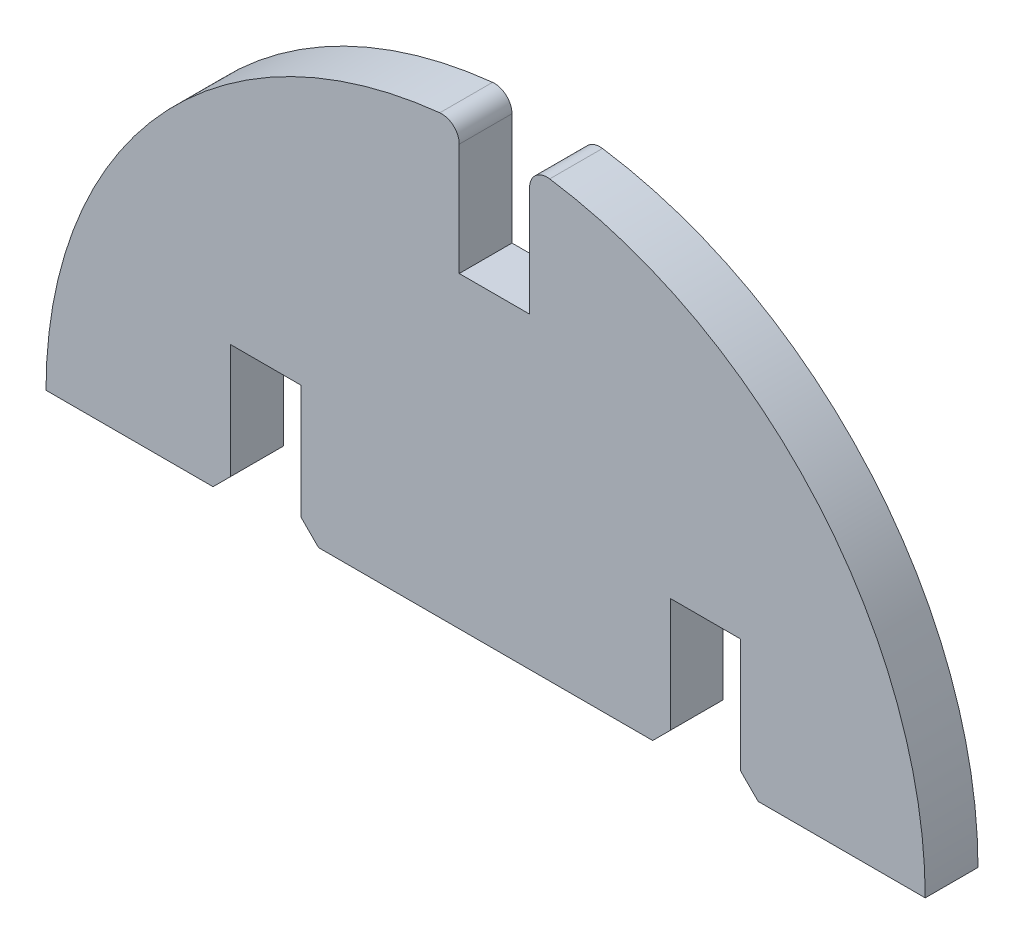
ISO-10303-21;
HEADER;
FILE_DESCRIPTION(('STEP AP214'),'2;1');
FILE_NAME('part.step','',(''),(''),'','','');
FILE_SCHEMA(('AUTOMOTIVE_DESIGN { 1 0 10303 214 1 1 1 1 }'));
ENDSEC;
DATA;
#1=APPLICATION_CONTEXT('core data for automotive mechanical design processes');
#2=APPLICATION_PROTOCOL_DEFINITION('international standard','automotive_design',2000,#1);
#3=PRODUCT_CONTEXT('',#1,'mechanical');
#4=PRODUCT('Part','Part','',(#3));
#5=PRODUCT_RELATED_PRODUCT_CATEGORY('part','',(#4));
#6=PRODUCT_DEFINITION_FORMATION('','',#4);
#7=PRODUCT_DEFINITION_CONTEXT('part definition',#1,'design');
#8=PRODUCT_DEFINITION('design','',#6,#7);
#9=PRODUCT_DEFINITION_SHAPE('','',#8);
#10=(LENGTH_UNIT() NAMED_UNIT(*) SI_UNIT(.MILLI.,.METRE.));
#11=(NAMED_UNIT(*) PLANE_ANGLE_UNIT() SI_UNIT($,.RADIAN.));
#12=(NAMED_UNIT(*) SI_UNIT($,.STERADIAN.) SOLID_ANGLE_UNIT());
#13=UNCERTAINTY_MEASURE_WITH_UNIT(LENGTH_MEASURE(1.E-05),#10,'distance_accuracy_value','');
#14=(GEOMETRIC_REPRESENTATION_CONTEXT(3) GLOBAL_UNCERTAINTY_ASSIGNED_CONTEXT((#13)) GLOBAL_UNIT_ASSIGNED_CONTEXT((#10,
#11,#12)) REPRESENTATION_CONTEXT('',''));
#15=CARTESIAN_POINT('',(0.,0.,0.));
#16=DIRECTION('',(0.,0.,1.));
#17=DIRECTION('',(1.,0.,0.));
#18=AXIS2_PLACEMENT_3D('',#15,#16,#17);
#19=CARTESIAN_POINT('',(-2.5,23.86943652456,3.));
#20=DIRECTION('',(0.,0.,-1.));
#21=DIRECTION('',(-1.,0.,0.));
#22=AXIS2_PLACEMENT_3D('',#19,#20,#21);
#23=CYLINDRICAL_SURFACE('',#22,0.999999999999998);
#24=CARTESIAN_POINT('',(-2.5,23.86943652456,0.));
#25=DIRECTION('',(0.,0.,1.));
#26=DIRECTION('',(1.,0.,0.));
#27=AXIS2_PLACEMENT_3D('',#24,#25,#26);
#28=CIRCLE('',#27,0.999999999999998);
#29=CARTESIAN_POINT('',(-1.5,23.86943652456,0.));
#30=VERTEX_POINT('',#29);
#31=CARTESIAN_POINT('',(-2.60416666666666,24.86399637975,0.));
#32=VERTEX_POINT('',#31);
#33=EDGE_CURVE('E201',#30,#32,#28,.T.);
#34=ORIENTED_EDGE('',*,*,#33,.T.);
#35=DIRECTION('',(0.,0.,-1.));
#36=VECTOR('',#35,1.);
#37=CARTESIAN_POINT('',(-2.60416666666666,24.86399637975,3.));
#38=LINE('',#37,#36);
#39=CARTESIAN_POINT('',(-2.60416666666666,24.86399637975,3.));
#40=VERTEX_POINT('',#39);
#41=EDGE_CURVE('E11',#40,#32,#38,.T.);
#42=ORIENTED_EDGE('',*,*,#41,.F.);
#43=CARTESIAN_POINT('',(-2.5,23.86943652456,3.));
#44=DIRECTION('',(0.,0.,1.));
#45=DIRECTION('',(1.,0.,0.));
#46=AXIS2_PLACEMENT_3D('',#43,#44,#45);
#47=CIRCLE('',#46,0.999999999999998);
#48=CARTESIAN_POINT('',(-1.5,23.86943652456,3.));
#49=VERTEX_POINT('',#48);
#50=EDGE_CURVE('E247',#49,#40,#47,.T.);
#51=ORIENTED_EDGE('',*,*,#50,.F.);
#52=DIRECTION('',(0.,0.,-1.));
#53=VECTOR('',#52,1.);
#54=CARTESIAN_POINT('',(-1.5,23.86943652456,3.));
#55=LINE('',#54,#53);
#56=EDGE_CURVE('E49',#49,#30,#55,.T.);
#57=ORIENTED_EDGE('',*,*,#56,.T.);
#58=EDGE_LOOP('',(#34,#42,#51,#57));
#59=FACE_BOUND('',#58,.T.);
#60=ADVANCED_FACE('F33',(#59),#23,.T.);
#61=CARTESIAN_POINT('',(0.,0.,3.));
#62=DIRECTION('',(0.,0.,-1.));
#63=DIRECTION('',(-1.,0.,0.));
#64=AXIS2_PLACEMENT_3D('',#61,#62,#63);
#65=CYLINDRICAL_SURFACE('',#64,25.);
#66=CARTESIAN_POINT('',(0.,0.,0.));
#67=DIRECTION('',(0.,0.,1.));
#68=DIRECTION('',(1.,0.,0.));
#69=AXIS2_PLACEMENT_3D('',#66,#67,#68);
#70=CIRCLE('',#69,25.);
#71=CARTESIAN_POINT('',(-25.,0.,0.));
#72=VERTEX_POINT('',#71);
#73=EDGE_CURVE('E203',#32,#72,#70,.T.);
#74=ORIENTED_EDGE('',*,*,#73,.T.);
#75=DIRECTION('',(0.,0.,-1.));
#76=VECTOR('',#75,1.);
#77=CARTESIAN_POINT('',(-25.,0.,3.));
#78=LINE('',#77,#76);
#79=CARTESIAN_POINT('',(-25.,0.,3.));
#80=VERTEX_POINT('',#79);
#81=EDGE_CURVE('E41',#80,#72,#78,.T.);
#82=ORIENTED_EDGE('',*,*,#81,.F.);
#83=CARTESIAN_POINT('',(0.,0.,3.));
#84=DIRECTION('',(0.,0.,1.));
#85=DIRECTION('',(1.,0.,0.));
#86=AXIS2_PLACEMENT_3D('',#83,#84,#85);
#87=CIRCLE('',#86,25.);
#88=EDGE_CURVE('E123',#40,#80,#87,.T.);
#89=ORIENTED_EDGE('',*,*,#88,.F.);
#90=ORIENTED_EDGE('',*,*,#41,.T.);
#91=EDGE_LOOP('',(#74,#82,#89,#90));
#92=FACE_BOUND('',#91,.T.);
#93=ADVANCED_FACE('F350',(#92),#65,.T.);
#94=CARTESIAN_POINT('',(-25.,0.,3.));
#95=DIRECTION('',(0.,1.,0.));
#96=DIRECTION('',(-1.,0.,0.));
#97=AXIS2_PLACEMENT_3D('',#94,#95,#96);
#98=PLANE('',#97);
#99=DIRECTION('',(1.,0.,0.));
#100=VECTOR('',#99,1.);
#101=CARTESIAN_POINT('',(-25.,0.,0.));
#102=LINE('',#101,#100);
#103=CARTESIAN_POINT('',(-15.5,0.,0.));
#104=VERTEX_POINT('',#103);
#105=EDGE_CURVE('E205',#72,#104,#102,.T.);
#106=ORIENTED_EDGE('',*,*,#105,.T.);
#107=DIRECTION('',(0.,0.,-1.));
#108=VECTOR('',#107,1.);
#109=CARTESIAN_POINT('',(-15.5,0.,3.));
#110=LINE('',#109,#108);
#111=CARTESIAN_POINT('',(-15.5,0.,3.));
#112=VERTEX_POINT('',#111);
#113=EDGE_CURVE('E285',#112,#104,#110,.T.);
#114=ORIENTED_EDGE('',*,*,#113,.F.);
#115=DIRECTION('',(1.,0.,0.));
#116=VECTOR('',#115,1.);
#117=CARTESIAN_POINT('',(-25.,0.,3.));
#118=LINE('',#117,#116);
#119=EDGE_CURVE('E293',#80,#112,#118,.T.);
#120=ORIENTED_EDGE('',*,*,#119,.F.);
#121=ORIENTED_EDGE('',*,*,#81,.T.);
#122=EDGE_LOOP('',(#106,#114,#120,#121));
#123=FACE_BOUND('',#122,.T.);
#124=ADVANCED_FACE('F291',(#123),#98,.F.);
#125=CARTESIAN_POINT('',(-15.5,0.,3.));
#126=DIRECTION('',(-0.707106781186547,0.707106781186548,0.));
#127=DIRECTION('',(-0.707106781186548,-0.707106781186547,0.));
#128=AXIS2_PLACEMENT_3D('',#125,#126,#127);
#129=PLANE('',#128);
#130=DIRECTION('',(0.707106781186548,0.707106781186547,0.));
#131=VECTOR('',#130,1.);
#132=CARTESIAN_POINT('',(-15.5,0.,0.));
#133=LINE('',#132,#131);
#134=CARTESIAN_POINT('',(-14.5,1.,0.));
#135=VERTEX_POINT('',#134);
#136=EDGE_CURVE('E207',#104,#135,#133,.T.);
#137=ORIENTED_EDGE('',*,*,#136,.T.);
#138=DIRECTION('',(0.,0.,-1.));
#139=VECTOR('',#138,1.);
#140=CARTESIAN_POINT('',(-14.5,1.,3.));
#141=LINE('',#140,#139);
#142=CARTESIAN_POINT('',(-14.5,1.,3.));
#143=VERTEX_POINT('',#142);
#144=EDGE_CURVE('E283',#143,#135,#141,.T.);
#145=ORIENTED_EDGE('',*,*,#144,.F.);
#146=DIRECTION('',(0.707106781186548,0.707106781186547,0.));
#147=VECTOR('',#146,1.);
#148=CARTESIAN_POINT('',(-15.5,0.,3.));
#149=LINE('',#148,#147);
#150=EDGE_CURVE('E304',#112,#143,#149,.T.);
#151=ORIENTED_EDGE('',*,*,#150,.F.);
#152=ORIENTED_EDGE('',*,*,#113,.T.);
#153=EDGE_LOOP('',(#137,#145,#151,#152));
#154=FACE_BOUND('',#153,.T.);
#155=ADVANCED_FACE('F301',(#154),#129,.F.);
#156=CARTESIAN_POINT('',(-14.5,7.50000000000001,3.));
#157=DIRECTION('',(1.,0.,0.));
#158=DIRECTION('',(0.,0.,-1.));
#159=AXIS2_PLACEMENT_3D('',#156,#157,#158);
#160=PLANE('',#159);
#161=DIRECTION('',(0.,-1.,0.));
#162=VECTOR('',#161,1.);
#163=CARTESIAN_POINT('',(-14.5,7.50000000000001,0.));
#164=LINE('',#163,#162);
#165=CARTESIAN_POINT('',(-14.5,7.50000000000001,0.));
#166=VERTEX_POINT('',#165);
#167=EDGE_CURVE('E210',#166,#135,#164,.T.);
#168=ORIENTED_EDGE('',*,*,#167,.F.);
#169=DIRECTION('',(0.,0.,-1.));
#170=VECTOR('',#169,1.);
#171=CARTESIAN_POINT('',(-14.5,7.50000000000001,3.));
#172=LINE('',#171,#170);
#173=CARTESIAN_POINT('',(-14.5,7.50000000000001,3.));
#174=VERTEX_POINT('',#173);
#175=EDGE_CURVE('E281',#174,#166,#172,.T.);
#176=ORIENTED_EDGE('',*,*,#175,.F.);
#177=DIRECTION('',(0.,-1.,0.));
#178=VECTOR('',#177,1.);
#179=CARTESIAN_POINT('',(-14.5,7.50000000000001,3.));
#180=LINE('',#179,#178);
#181=EDGE_CURVE('E306',#174,#143,#180,.T.);
#182=ORIENTED_EDGE('',*,*,#181,.T.);
#183=ORIENTED_EDGE('',*,*,#144,.T.);
#184=EDGE_LOOP('',(#168,#176,#182,#183));
#185=FACE_BOUND('',#184,.T.);
#186=ADVANCED_FACE('F363',(#185),#160,.T.);
#187=CARTESIAN_POINT('',(-14.5,7.50000000000001,3.));
#188=DIRECTION('',(0.,1.,0.));
#189=DIRECTION('',(0.,0.,1.));
#190=AXIS2_PLACEMENT_3D('',#187,#188,#189);
#191=PLANE('',#190);
#192=DIRECTION('',(1.,0.,0.));
#193=VECTOR('',#192,1.);
#194=CARTESIAN_POINT('',(-14.5,7.50000000000001,0.));
#195=LINE('',#194,#193);
#196=CARTESIAN_POINT('',(-10.5,7.50000000000001,0.));
#197=VERTEX_POINT('',#196);
#198=EDGE_CURVE('E213',#166,#197,#195,.T.);
#199=ORIENTED_EDGE('',*,*,#198,.T.);
#200=DIRECTION('',(0.,0.,-1.));
#201=VECTOR('',#200,1.);
#202=CARTESIAN_POINT('',(-10.5,7.50000000000001,3.));
#203=LINE('',#202,#201);
#204=CARTESIAN_POINT('',(-10.5,7.50000000000001,3.));
#205=VERTEX_POINT('',#204);
#206=EDGE_CURVE('E278',#205,#197,#203,.T.);
#207=ORIENTED_EDGE('',*,*,#206,.F.);
#208=DIRECTION('',(1.,0.,0.));
#209=VECTOR('',#208,1.);
#210=CARTESIAN_POINT('',(-14.5,7.50000000000001,3.));
#211=LINE('',#210,#209);
#212=EDGE_CURVE('E308',#174,#205,#211,.T.);
#213=ORIENTED_EDGE('',*,*,#212,.F.);
#214=ORIENTED_EDGE('',*,*,#175,.T.);
#215=EDGE_LOOP('',(#199,#207,#213,#214));
#216=FACE_BOUND('',#215,.T.);
#217=ADVANCED_FACE('F366',(#216),#191,.F.);
#218=CARTESIAN_POINT('',(-10.5,7.50000000000001,3.));
#219=DIRECTION('',(1.,0.,0.));
#220=DIRECTION('',(0.,1.,0.));
#221=AXIS2_PLACEMENT_3D('',#218,#219,#220);
#222=PLANE('',#221);
#223=DIRECTION('',(0.,-1.,0.));
#224=VECTOR('',#223,1.);
#225=CARTESIAN_POINT('',(-10.5,7.50000000000001,0.));
#226=LINE('',#225,#224);
#227=CARTESIAN_POINT('',(-10.5,1.,0.));
#228=VERTEX_POINT('',#227);
#229=EDGE_CURVE('E215',#197,#228,#226,.T.);
#230=ORIENTED_EDGE('',*,*,#229,.T.);
#231=DIRECTION('',(0.,0.,-1.));
#232=VECTOR('',#231,1.);
#233=CARTESIAN_POINT('',(-10.5,1.,3.));
#234=LINE('',#233,#232);
#235=CARTESIAN_POINT('',(-10.5,1.,3.));
#236=VERTEX_POINT('',#235);
#237=EDGE_CURVE('E275',#236,#228,#234,.T.);
#238=ORIENTED_EDGE('',*,*,#237,.F.);
#239=DIRECTION('',(0.,-1.,0.));
#240=VECTOR('',#239,1.);
#241=CARTESIAN_POINT('',(-10.5,7.50000000000001,3.));
#242=LINE('',#241,#240);
#243=EDGE_CURVE('E314',#205,#236,#242,.T.);
#244=ORIENTED_EDGE('',*,*,#243,.F.);
#245=ORIENTED_EDGE('',*,*,#206,.T.);
#246=EDGE_LOOP('',(#230,#238,#244,#245));
#247=FACE_BOUND('',#246,.T.);
#248=ADVANCED_FACE('F370',(#247),#222,.F.);
#249=CARTESIAN_POINT('',(-10.5,1.,3.));
#250=DIRECTION('',(0.707106781186547,0.707106781186548,0.));
#251=DIRECTION('',(-0.707106781186548,0.707106781186547,0.));
#252=AXIS2_PLACEMENT_3D('',#249,#250,#251);
#253=PLANE('',#252);
#254=DIRECTION('',(0.707106781186548,-0.707106781186547,0.));
#255=VECTOR('',#254,1.);
#256=CARTESIAN_POINT('',(-10.5,1.,0.));
#257=LINE('',#256,#255);
#258=CARTESIAN_POINT('',(-9.5,0.,0.));
#259=VERTEX_POINT('',#258);
#260=EDGE_CURVE('E217',#228,#259,#257,.T.);
#261=ORIENTED_EDGE('',*,*,#260,.T.);
#262=DIRECTION('',(0.,0.,-1.));
#263=VECTOR('',#262,1.);
#264=CARTESIAN_POINT('',(-9.5,0.,3.));
#265=LINE('',#264,#263);
#266=CARTESIAN_POINT('',(-9.5,0.,3.));
#267=VERTEX_POINT('',#266);
#268=EDGE_CURVE('E272',#267,#259,#265,.T.);
#269=ORIENTED_EDGE('',*,*,#268,.F.);
#270=DIRECTION('',(0.707106781186548,-0.707106781186547,0.));
#271=VECTOR('',#270,1.);
#272=CARTESIAN_POINT('',(-10.5,1.,3.));
#273=LINE('',#272,#271);
#274=EDGE_CURVE('E316',#236,#267,#273,.T.);
#275=ORIENTED_EDGE('',*,*,#274,.F.);
#276=ORIENTED_EDGE('',*,*,#237,.T.);
#277=EDGE_LOOP('',(#261,#269,#275,#276));
#278=FACE_BOUND('',#277,.T.);
#279=ADVANCED_FACE('F374',(#278),#253,.F.);
#280=CARTESIAN_POINT('',(-9.5,0.,3.));
#281=DIRECTION('',(0.,1.,0.));
#282=DIRECTION('',(0.,0.,1.));
#283=AXIS2_PLACEMENT_3D('',#280,#281,#282);
#284=PLANE('',#283);
#285=DIRECTION('',(1.,0.,0.));
#286=VECTOR('',#285,1.);
#287=CARTESIAN_POINT('',(-9.5,0.,0.));
#288=LINE('',#287,#286);
#289=CARTESIAN_POINT('',(9.5,0.,0.));
#290=VERTEX_POINT('',#289);
#291=EDGE_CURVE('E219',#259,#290,#288,.T.);
#292=ORIENTED_EDGE('',*,*,#291,.T.);
#293=DIRECTION('',(0.,0.,-1.));
#294=VECTOR('',#293,1.);
#295=CARTESIAN_POINT('',(9.5,0.,3.));
#296=LINE('',#295,#294);
#297=CARTESIAN_POINT('',(9.5,0.,3.));
#298=VERTEX_POINT('',#297);
#299=EDGE_CURVE('E269',#298,#290,#296,.T.);
#300=ORIENTED_EDGE('',*,*,#299,.F.);
#301=DIRECTION('',(1.,0.,0.));
#302=VECTOR('',#301,1.);
#303=CARTESIAN_POINT('',(-9.5,0.,3.));
#304=LINE('',#303,#302);
#305=EDGE_CURVE('E318',#267,#298,#304,.T.);
#306=ORIENTED_EDGE('',*,*,#305,.F.);
#307=ORIENTED_EDGE('',*,*,#268,.T.);
#308=EDGE_LOOP('',(#292,#300,#306,#307));
#309=FACE_BOUND('',#308,.T.);
#310=ADVANCED_FACE('F378',(#309),#284,.F.);
#311=CARTESIAN_POINT('',(9.5,0.,3.));
#312=DIRECTION('',(-0.707106781186547,0.707106781186548,0.));
#313=DIRECTION('',(-0.707106781186548,-0.707106781186547,0.));
#314=AXIS2_PLACEMENT_3D('',#311,#312,#313);
#315=PLANE('',#314);
#316=DIRECTION('',(0.707106781186548,0.707106781186547,0.));
#317=VECTOR('',#316,1.);
#318=CARTESIAN_POINT('',(9.5,0.,0.));
#319=LINE('',#318,#317);
#320=CARTESIAN_POINT('',(10.5,1.,0.));
#321=VERTEX_POINT('',#320);
#322=EDGE_CURVE('E221',#290,#321,#319,.T.);
#323=ORIENTED_EDGE('',*,*,#322,.T.);
#324=DIRECTION('',(0.,0.,-1.));
#325=VECTOR('',#324,1.);
#326=CARTESIAN_POINT('',(10.5,1.,3.));
#327=LINE('',#326,#325);
#328=CARTESIAN_POINT('',(10.5,1.,3.));
#329=VERTEX_POINT('',#328);
#330=EDGE_CURVE('E267',#329,#321,#327,.T.);
#331=ORIENTED_EDGE('',*,*,#330,.F.);
#332=DIRECTION('',(0.707106781186548,0.707106781186547,0.));
#333=VECTOR('',#332,1.);
#334=CARTESIAN_POINT('',(9.5,0.,3.));
#335=LINE('',#334,#333);
#336=EDGE_CURVE('E320',#298,#329,#335,.T.);
#337=ORIENTED_EDGE('',*,*,#336,.F.);
#338=ORIENTED_EDGE('',*,*,#299,.T.);
#339=EDGE_LOOP('',(#323,#331,#337,#338));
#340=FACE_BOUND('',#339,.T.);
#341=ADVANCED_FACE('F382',(#340),#315,.F.);
#342=CARTESIAN_POINT('',(10.5,7.50000000000001,3.));
#343=DIRECTION('',(1.,0.,0.));
#344=DIRECTION('',(0.,0.,-1.));
#345=AXIS2_PLACEMENT_3D('',#342,#343,#344);
#346=PLANE('',#345);
#347=DIRECTION('',(0.,-1.,0.));
#348=VECTOR('',#347,1.);
#349=CARTESIAN_POINT('',(10.5,7.50000000000001,0.));
#350=LINE('',#349,#348);
#351=CARTESIAN_POINT('',(10.5,7.50000000000001,0.));
#352=VERTEX_POINT('',#351);
#353=EDGE_CURVE('E224',#352,#321,#350,.T.);
#354=ORIENTED_EDGE('',*,*,#353,.F.);
#355=DIRECTION('',(0.,0.,-1.));
#356=VECTOR('',#355,1.);
#357=CARTESIAN_POINT('',(10.5,7.50000000000001,3.));
#358=LINE('',#357,#356);
#359=CARTESIAN_POINT('',(10.5,7.50000000000001,3.));
#360=VERTEX_POINT('',#359);
#361=EDGE_CURVE('E265',#360,#352,#358,.T.);
#362=ORIENTED_EDGE('',*,*,#361,.F.);
#363=DIRECTION('',(0.,-1.,0.));
#364=VECTOR('',#363,1.);
#365=CARTESIAN_POINT('',(10.5,7.50000000000001,3.));
#366=LINE('',#365,#364);
#367=EDGE_CURVE('E322',#360,#329,#366,.T.);
#368=ORIENTED_EDGE('',*,*,#367,.T.);
#369=ORIENTED_EDGE('',*,*,#330,.T.);
#370=EDGE_LOOP('',(#354,#362,#368,#369));
#371=FACE_BOUND('',#370,.T.);
#372=ADVANCED_FACE('F386',(#371),#346,.T.);
#373=CARTESIAN_POINT('',(10.5,7.50000000000001,3.));
#374=DIRECTION('',(0.,1.,0.));
#375=DIRECTION('',(0.,0.,1.));
#376=AXIS2_PLACEMENT_3D('',#373,#374,#375);
#377=PLANE('',#376);
#378=DIRECTION('',(1.,0.,0.));
#379=VECTOR('',#378,1.);
#380=CARTESIAN_POINT('',(10.5,7.50000000000001,0.));
#381=LINE('',#380,#379);
#382=CARTESIAN_POINT('',(14.5,7.50000000000001,0.));
#383=VERTEX_POINT('',#382);
#384=EDGE_CURVE('E227',#352,#383,#381,.T.);
#385=ORIENTED_EDGE('',*,*,#384,.T.);
#386=DIRECTION('',(0.,0.,-1.));
#387=VECTOR('',#386,1.);
#388=CARTESIAN_POINT('',(14.5,7.50000000000001,3.));
#389=LINE('',#388,#387);
#390=CARTESIAN_POINT('',(14.5,7.50000000000001,3.));
#391=VERTEX_POINT('',#390);
#392=EDGE_CURVE('E262',#391,#383,#389,.T.);
#393=ORIENTED_EDGE('',*,*,#392,.F.);
#394=DIRECTION('',(1.,0.,0.));
#395=VECTOR('',#394,1.);
#396=CARTESIAN_POINT('',(10.5,7.50000000000001,3.));
#397=LINE('',#396,#395);
#398=EDGE_CURVE('E325',#360,#391,#397,.T.);
#399=ORIENTED_EDGE('',*,*,#398,.F.);
#400=ORIENTED_EDGE('',*,*,#361,.T.);
#401=EDGE_LOOP('',(#385,#393,#399,#400));
#402=FACE_BOUND('',#401,.T.);
#403=ADVANCED_FACE('F390',(#402),#377,.F.);
#404=CARTESIAN_POINT('',(14.5,7.50000000000001,3.));
#405=DIRECTION('',(1.,0.,0.));
#406=DIRECTION('',(0.,1.,0.));
#407=AXIS2_PLACEMENT_3D('',#404,#405,#406);
#408=PLANE('',#407);
#409=DIRECTION('',(0.,-1.,0.));
#410=VECTOR('',#409,1.);
#411=CARTESIAN_POINT('',(14.5,7.50000000000001,0.));
#412=LINE('',#411,#410);
#413=CARTESIAN_POINT('',(14.5,1.,0.));
#414=VERTEX_POINT('',#413);
#415=EDGE_CURVE('E229',#383,#414,#412,.T.);
#416=ORIENTED_EDGE('',*,*,#415,.T.);
#417=DIRECTION('',(0.,0.,-1.));
#418=VECTOR('',#417,1.);
#419=CARTESIAN_POINT('',(14.5,1.,3.));
#420=LINE('',#419,#418);
#421=CARTESIAN_POINT('',(14.5,1.,3.));
#422=VERTEX_POINT('',#421);
#423=EDGE_CURVE('E259',#422,#414,#420,.T.);
#424=ORIENTED_EDGE('',*,*,#423,.F.);
#425=DIRECTION('',(0.,-1.,0.));
#426=VECTOR('',#425,1.);
#427=CARTESIAN_POINT('',(14.5,7.50000000000001,3.));
#428=LINE('',#427,#426);
#429=EDGE_CURVE('E327',#391,#422,#428,.T.);
#430=ORIENTED_EDGE('',*,*,#429,.F.);
#431=ORIENTED_EDGE('',*,*,#392,.T.);
#432=EDGE_LOOP('',(#416,#424,#430,#431));
#433=FACE_BOUND('',#432,.T.);
#434=ADVANCED_FACE('F394',(#433),#408,.F.);
#435=CARTESIAN_POINT('',(14.5,1.,3.));
#436=DIRECTION('',(0.707106781186547,0.707106781186548,0.));
#437=DIRECTION('',(-0.707106781186548,0.707106781186547,0.));
#438=AXIS2_PLACEMENT_3D('',#435,#436,#437);
#439=PLANE('',#438);
#440=DIRECTION('',(0.707106781186548,-0.707106781186547,0.));
#441=VECTOR('',#440,1.);
#442=CARTESIAN_POINT('',(14.5,1.,0.));
#443=LINE('',#442,#441);
#444=CARTESIAN_POINT('',(15.5,0.,0.));
#445=VERTEX_POINT('',#444);
#446=EDGE_CURVE('E231',#414,#445,#443,.T.);
#447=ORIENTED_EDGE('',*,*,#446,.T.);
#448=DIRECTION('',(0.,0.,-1.));
#449=VECTOR('',#448,1.);
#450=CARTESIAN_POINT('',(15.5,0.,3.));
#451=LINE('',#450,#449);
#452=CARTESIAN_POINT('',(15.5,0.,3.));
#453=VERTEX_POINT('',#452);
#454=EDGE_CURVE('E256',#453,#445,#451,.T.);
#455=ORIENTED_EDGE('',*,*,#454,.F.);
#456=DIRECTION('',(0.707106781186548,-0.707106781186547,0.));
#457=VECTOR('',#456,1.);
#458=CARTESIAN_POINT('',(14.5,1.,3.));
#459=LINE('',#458,#457);
#460=EDGE_CURVE('E329',#422,#453,#459,.T.);
#461=ORIENTED_EDGE('',*,*,#460,.F.);
#462=ORIENTED_EDGE('',*,*,#423,.T.);
#463=EDGE_LOOP('',(#447,#455,#461,#462));
#464=FACE_BOUND('',#463,.T.);
#465=ADVANCED_FACE('F398',(#464),#439,.F.);
#466=CARTESIAN_POINT('',(15.5,0.,3.));
#467=DIRECTION('',(0.,1.,0.));
#468=DIRECTION('',(-1.,0.,0.));
#469=AXIS2_PLACEMENT_3D('',#466,#467,#468);
#470=PLANE('',#469);
#471=DIRECTION('',(1.,0.,0.));
#472=VECTOR('',#471,1.);
#473=CARTESIAN_POINT('',(15.5,0.,0.));
#474=LINE('',#473,#472);
#475=CARTESIAN_POINT('',(25.,0.,0.));
#476=VERTEX_POINT('',#475);
#477=EDGE_CURVE('E233',#445,#476,#474,.T.);
#478=ORIENTED_EDGE('',*,*,#477,.T.);
#479=DIRECTION('',(0.,0.,-1.));
#480=VECTOR('',#479,1.);
#481=CARTESIAN_POINT('',(25.,0.,3.));
#482=LINE('',#481,#480);
#483=CARTESIAN_POINT('',(25.,0.,3.));
#484=VERTEX_POINT('',#483);
#485=EDGE_CURVE('E253',#484,#476,#482,.T.);
#486=ORIENTED_EDGE('',*,*,#485,.F.);
#487=DIRECTION('',(1.,0.,0.));
#488=VECTOR('',#487,1.);
#489=CARTESIAN_POINT('',(15.5,0.,3.));
#490=LINE('',#489,#488);
#491=EDGE_CURVE('E331',#453,#484,#490,.T.);
#492=ORIENTED_EDGE('',*,*,#491,.F.);
#493=ORIENTED_EDGE('',*,*,#454,.T.);
#494=EDGE_LOOP('',(#478,#486,#492,#493));
#495=FACE_BOUND('',#494,.T.);
#496=ADVANCED_FACE('F402',(#495),#470,.F.);
#497=CARTESIAN_POINT('',(0.,0.,3.));
#498=DIRECTION('',(0.,0.,-1.));
#499=DIRECTION('',(-1.,0.,0.));
#500=AXIS2_PLACEMENT_3D('',#497,#498,#499);
#501=CYLINDRICAL_SURFACE('',#500,25.);
#502=CARTESIAN_POINT('',(0.,0.,0.));
#503=DIRECTION('',(0.,0.,1.));
#504=DIRECTION('',(1.,0.,0.));
#505=AXIS2_PLACEMENT_3D('',#502,#503,#504);
#506=CIRCLE('',#505,25.);
#507=CARTESIAN_POINT('',(3.64583333333334,24.7327293137162,0.));
#508=VERTEX_POINT('',#507);
#509=EDGE_CURVE('E235',#476,#508,#506,.T.);
#510=ORIENTED_EDGE('',*,*,#509,.T.);
#511=DIRECTION('',(0.,0.,-1.));
#512=VECTOR('',#511,1.);
#513=CARTESIAN_POINT('',(3.64583333333334,24.7327293137162,3.));
#514=LINE('',#513,#512);
#515=CARTESIAN_POINT('',(3.64583333333334,24.7327293137162,3.));
#516=VERTEX_POINT('',#515);
#517=EDGE_CURVE('E251',#516,#508,#514,.T.);
#518=ORIENTED_EDGE('',*,*,#517,.F.);
#519=CARTESIAN_POINT('',(0.,0.,3.));
#520=DIRECTION('',(0.,0.,1.));
#521=DIRECTION('',(1.,0.,0.));
#522=AXIS2_PLACEMENT_3D('',#519,#520,#521);
#523=CIRCLE('',#522,25.);
#524=EDGE_CURVE('E333',#484,#516,#523,.T.);
#525=ORIENTED_EDGE('',*,*,#524,.F.);
#526=ORIENTED_EDGE('',*,*,#485,.T.);
#527=EDGE_LOOP('',(#510,#518,#525,#526));
#528=FACE_BOUND('',#527,.T.);
#529=ADVANCED_FACE('F406',(#528),#501,.T.);
#530=CARTESIAN_POINT('',(3.5,23.7434201411675,3.));
#531=DIRECTION('',(0.,0.,-1.));
#532=DIRECTION('',(-1.,0.,0.));
#533=AXIS2_PLACEMENT_3D('',#530,#531,#532);
#534=CYLINDRICAL_SURFACE('',#533,1.);
#535=CARTESIAN_POINT('',(3.5,23.7434201411675,0.));
#536=DIRECTION('',(0.,0.,-1.));
#537=DIRECTION('',(-1.,0.,0.));
#538=AXIS2_PLACEMENT_3D('',#535,#536,#537);
#539=CIRCLE('',#538,1.);
#540=CARTESIAN_POINT('',(2.5,23.7434201411675,0.));
#541=VERTEX_POINT('',#540);
#542=EDGE_CURVE('E238',#541,#508,#539,.T.);
#543=ORIENTED_EDGE('',*,*,#542,.F.);
#544=DIRECTION('',(0.,0.,-1.));
#545=VECTOR('',#544,1.);
#546=CARTESIAN_POINT('',(2.5,23.7434201411675,3.));
#547=LINE('',#546,#545);
#548=CARTESIAN_POINT('',(2.5,23.7434201411675,3.));
#549=VERTEX_POINT('',#548);
#550=EDGE_CURVE('E193',#549,#541,#547,.T.);
#551=ORIENTED_EDGE('',*,*,#550,.F.);
#552=CARTESIAN_POINT('',(3.5,23.7434201411675,3.));
#553=DIRECTION('',(0.,0.,-1.));
#554=DIRECTION('',(-1.,0.,0.));
#555=AXIS2_PLACEMENT_3D('',#552,#553,#554);
#556=CIRCLE('',#555,1.);
#557=EDGE_CURVE('E183',#549,#516,#556,.T.);
#558=ORIENTED_EDGE('',*,*,#557,.T.);
#559=ORIENTED_EDGE('',*,*,#517,.T.);
#560=EDGE_LOOP('',(#543,#551,#558,#559));
#561=FACE_BOUND('',#560,.T.);
#562=ADVANCED_FACE('F336',(#561),#534,.T.);
#563=CARTESIAN_POINT('',(2.5,23.7434201411675,3.));
#564=DIRECTION('',(1.,0.,0.));
#565=DIRECTION('',(0.,1.,0.));
#566=AXIS2_PLACEMENT_3D('',#563,#564,#565);
#567=PLANE('',#566);
#568=DIRECTION('',(0.,-1.,0.));
#569=VECTOR('',#568,1.);
#570=CARTESIAN_POINT('',(2.5,23.7434201411675,0.));
#571=LINE('',#570,#569);
#572=CARTESIAN_POINT('',(2.5,17.5,0.));
#573=VERTEX_POINT('',#572);
#574=EDGE_CURVE('E190',#541,#573,#571,.T.);
#575=ORIENTED_EDGE('',*,*,#574,.T.);
#576=DIRECTION('',(0.,0.,-1.));
#577=VECTOR('',#576,1.);
#578=CARTESIAN_POINT('',(2.5,17.5,3.));
#579=LINE('',#578,#577);
#580=CARTESIAN_POINT('',(2.5,17.5,3.));
#581=VERTEX_POINT('',#580);
#582=EDGE_CURVE('E187',#581,#573,#579,.T.);
#583=ORIENTED_EDGE('',*,*,#582,.F.);
#584=DIRECTION('',(0.,-1.,0.));
#585=VECTOR('',#584,1.);
#586=CARTESIAN_POINT('',(2.5,23.7434201411675,3.));
#587=LINE('',#586,#585);
#588=EDGE_CURVE('E176',#549,#581,#587,.T.);
#589=ORIENTED_EDGE('',*,*,#588,.F.);
#590=ORIENTED_EDGE('',*,*,#550,.T.);
#591=EDGE_LOOP('',(#575,#583,#589,#590));
#592=FACE_BOUND('',#591,.T.);
#593=ADVANCED_FACE('F188',(#592),#567,.F.);
#594=CARTESIAN_POINT('',(-1.5,17.5,3.));
#595=DIRECTION('',(0.,1.,0.));
#596=DIRECTION('',(0.,0.,1.));
#597=AXIS2_PLACEMENT_3D('',#594,#595,#596);
#598=PLANE('',#597);
#599=DIRECTION('',(1.,0.,0.));
#600=VECTOR('',#599,1.);
#601=CARTESIAN_POINT('',(-1.5,17.5,0.));
#602=LINE('',#601,#600);
#603=CARTESIAN_POINT('',(-1.5,17.5,0.));
#604=VERTEX_POINT('',#603);
#605=EDGE_CURVE('E242',#604,#573,#602,.T.);
#606=ORIENTED_EDGE('',*,*,#605,.F.);
#607=DIRECTION('',(0.,0.,-1.));
#608=VECTOR('',#607,1.);
#609=CARTESIAN_POINT('',(-1.5,17.5,3.));
#610=LINE('',#609,#608);
#611=CARTESIAN_POINT('',(-1.5,17.5,3.));
#612=VERTEX_POINT('',#611);
#613=EDGE_CURVE('E111',#612,#604,#610,.T.);
#614=ORIENTED_EDGE('',*,*,#613,.F.);
#615=DIRECTION('',(1.,0.,0.));
#616=VECTOR('',#615,1.);
#617=CARTESIAN_POINT('',(-1.5,17.5,3.));
#618=LINE('',#617,#616);
#619=EDGE_CURVE('E181',#612,#581,#618,.T.);
#620=ORIENTED_EDGE('',*,*,#619,.T.);
#621=ORIENTED_EDGE('',*,*,#582,.T.);
#622=EDGE_LOOP('',(#606,#614,#620,#621));
#623=FACE_BOUND('',#622,.T.);
#624=ADVANCED_FACE('F195',(#623),#598,.T.);
#625=CARTESIAN_POINT('',(-1.5,23.86943652456,3.));
#626=DIRECTION('',(1.,0.,0.));
#627=DIRECTION('',(0.,1.,0.));
#628=AXIS2_PLACEMENT_3D('',#625,#626,#627);
#629=PLANE('',#628);
#630=DIRECTION('',(0.,-1.,0.));
#631=VECTOR('',#630,1.);
#632=CARTESIAN_POINT('',(-1.5,23.86943652456,0.));
#633=LINE('',#632,#631);
#634=EDGE_CURVE('E244',#30,#604,#633,.T.);
#635=ORIENTED_EDGE('',*,*,#634,.F.);
#636=ORIENTED_EDGE('',*,*,#56,.F.);
#637=DIRECTION('',(0.,-1.,0.));
#638=VECTOR('',#637,1.);
#639=CARTESIAN_POINT('',(-1.5,23.86943652456,3.));
#640=LINE('',#639,#638);
#641=EDGE_CURVE('E196',#49,#612,#640,.T.);
#642=ORIENTED_EDGE('',*,*,#641,.T.);
#643=ORIENTED_EDGE('',*,*,#613,.T.);
#644=EDGE_LOOP('',(#635,#636,#642,#643));
#645=FACE_BOUND('',#644,.T.);
#646=ADVANCED_FACE('F339',(#645),#629,.T.);
#647=CARTESIAN_POINT('',(-2.5,23.86943652456,3.));
#648=DIRECTION('',(0.,0.,1.));
#649=DIRECTION('',(1.,0.,0.));
#650=AXIS2_PLACEMENT_3D('',#647,#648,#649);
#651=PLANE('',#650);
#652=ORIENTED_EDGE('',*,*,#50,.T.);
#653=ORIENTED_EDGE('',*,*,#88,.T.);
#654=ORIENTED_EDGE('',*,*,#119,.T.);
#655=ORIENTED_EDGE('',*,*,#150,.T.);
#656=ORIENTED_EDGE('',*,*,#181,.F.);
#657=ORIENTED_EDGE('',*,*,#212,.T.);
#658=ORIENTED_EDGE('',*,*,#243,.T.);
#659=ORIENTED_EDGE('',*,*,#274,.T.);
#660=ORIENTED_EDGE('',*,*,#305,.T.);
#661=ORIENTED_EDGE('',*,*,#336,.T.);
#662=ORIENTED_EDGE('',*,*,#367,.F.);
#663=ORIENTED_EDGE('',*,*,#398,.T.);
#664=ORIENTED_EDGE('',*,*,#429,.T.);
#665=ORIENTED_EDGE('',*,*,#460,.T.);
#666=ORIENTED_EDGE('',*,*,#491,.T.);
#667=ORIENTED_EDGE('',*,*,#524,.T.);
#668=ORIENTED_EDGE('',*,*,#557,.F.);
#669=ORIENTED_EDGE('',*,*,#588,.T.);
#670=ORIENTED_EDGE('',*,*,#619,.F.);
#671=ORIENTED_EDGE('',*,*,#641,.F.);
#672=EDGE_LOOP('',(#652,#653,#654,#655,#656,#657,#658,#659,#660,#661,#662,#663,#664,#665,#666,
#667,#668,#669,#670,#671));
#673=FACE_BOUND('',#672,.T.);
#674=ADVANCED_FACE('F178',(#673),#651,.T.);
#675=CARTESIAN_POINT('',(-2.5,23.86943652456,0.));
#676=DIRECTION('',(0.,0.,1.));
#677=DIRECTION('',(1.,0.,0.));
#678=AXIS2_PLACEMENT_3D('',#675,#676,#677);
#679=PLANE('',#678);
#680=ORIENTED_EDGE('',*,*,#33,.F.);
#681=ORIENTED_EDGE('',*,*,#634,.T.);
#682=ORIENTED_EDGE('',*,*,#605,.T.);
#683=ORIENTED_EDGE('',*,*,#574,.F.);
#684=ORIENTED_EDGE('',*,*,#542,.T.);
#685=ORIENTED_EDGE('',*,*,#509,.F.);
#686=ORIENTED_EDGE('',*,*,#477,.F.);
#687=ORIENTED_EDGE('',*,*,#446,.F.);
#688=ORIENTED_EDGE('',*,*,#415,.F.);
#689=ORIENTED_EDGE('',*,*,#384,.F.);
#690=ORIENTED_EDGE('',*,*,#353,.T.);
#691=ORIENTED_EDGE('',*,*,#322,.F.);
#692=ORIENTED_EDGE('',*,*,#291,.F.);
#693=ORIENTED_EDGE('',*,*,#260,.F.);
#694=ORIENTED_EDGE('',*,*,#229,.F.);
#695=ORIENTED_EDGE('',*,*,#198,.F.);
#696=ORIENTED_EDGE('',*,*,#167,.T.);
#697=ORIENTED_EDGE('',*,*,#136,.F.);
#698=ORIENTED_EDGE('',*,*,#105,.F.);
#699=ORIENTED_EDGE('',*,*,#73,.F.);
#700=EDGE_LOOP('',(#680,#681,#682,#683,#684,#685,#686,#687,#688,#689,#690,#691,#692,#693,#694,
#695,#696,#697,#698,#699));
#701=FACE_BOUND('',#700,.T.);
#702=ADVANCED_FACE('F296',(#701),#679,.F.);
#703=CLOSED_SHELL('',(#60,#93,#124,#155,#186,#217,#248,#279,#310,#341,#372,#403,#434,#465,#496,
#529,#562,#593,#624,#646,#674,#702));
#704=MANIFOLD_SOLID_BREP('B2',#703);
#705=ADVANCED_BREP_SHAPE_REPRESENTATION('',(#18,#704),#14);
#706=SHAPE_DEFINITION_REPRESENTATION(#9,#705);
ENDSEC;
END-ISO-10303-21;
